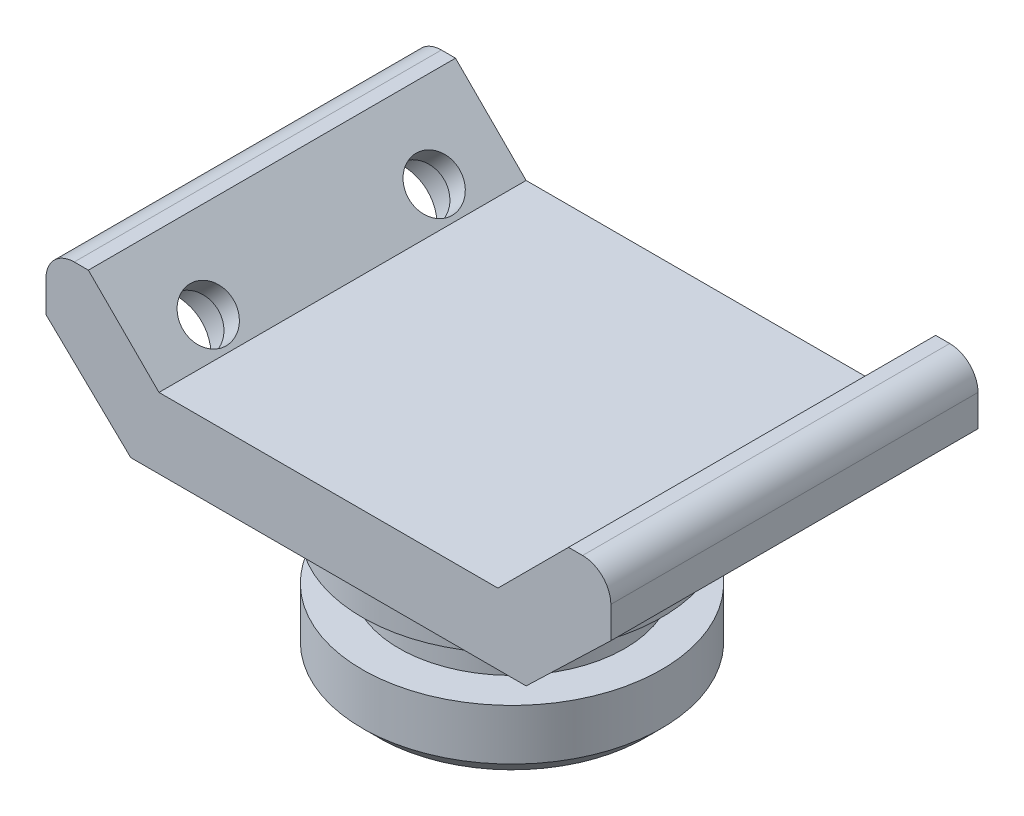
ISO-10303-21;
HEADER;
FILE_DESCRIPTION(('STEP AP214'),'2;1');
FILE_NAME('part.step','',(''),(''),'','','');
FILE_SCHEMA(('AUTOMOTIVE_DESIGN { 1 0 10303 214 1 1 1 1 }'));
ENDSEC;
DATA;
#1=APPLICATION_CONTEXT('core data for automotive mechanical design processes');
#2=APPLICATION_PROTOCOL_DEFINITION('international standard','automotive_design',2000,#1);
#3=PRODUCT_CONTEXT('',#1,'mechanical');
#4=PRODUCT('Part','Part','',(#3));
#5=PRODUCT_RELATED_PRODUCT_CATEGORY('part','',(#4));
#6=PRODUCT_DEFINITION_FORMATION('','',#4);
#7=PRODUCT_DEFINITION_CONTEXT('part definition',#1,'design');
#8=PRODUCT_DEFINITION('design','',#6,#7);
#9=PRODUCT_DEFINITION_SHAPE('','',#8);
#10=(LENGTH_UNIT() NAMED_UNIT(*) SI_UNIT(.MILLI.,.METRE.));
#11=(NAMED_UNIT(*) PLANE_ANGLE_UNIT() SI_UNIT($,.RADIAN.));
#12=(NAMED_UNIT(*) SI_UNIT($,.STERADIAN.) SOLID_ANGLE_UNIT());
#13=UNCERTAINTY_MEASURE_WITH_UNIT(LENGTH_MEASURE(1.E-05),#10,'distance_accuracy_value','');
#14=(GEOMETRIC_REPRESENTATION_CONTEXT(3) GLOBAL_UNCERTAINTY_ASSIGNED_CONTEXT((#13)) GLOBAL_UNIT_ASSIGNED_CONTEXT((#10,
#11,#12)) REPRESENTATION_CONTEXT('',''));
#15=CARTESIAN_POINT('',(0.,0.,0.));
#16=DIRECTION('',(0.,0.,1.));
#17=DIRECTION('',(1.,0.,0.));
#18=AXIS2_PLACEMENT_3D('',#15,#16,#17);
#19=CARTESIAN_POINT('',(35.,0.,32.5));
#20=DIRECTION('',(-0.693149330244424,0.720794010783737,0.));
#21=DIRECTION('',(-0.720794010783737,-0.693149330244424,0.));
#22=AXIS2_PLACEMENT_3D('',#19,#20,#21);
#23=PLANE('',#22);
#24=CARTESIAN_POINT('',(42.5,7.21235179407303,20.));
#25=DIRECTION('',(0.693149330244424,-0.720794010783737,0.));
#26=DIRECTION('',(0.720794010783737,0.693149330244424,0.));
#27=AXIS2_PLACEMENT_3D('',#24,#25,#26);
#28=CIRCLE('',#27,7.5);
#29=CARTESIAN_POINT('',(47.905955080878,12.4109717709062,20.));
#30=VERTEX_POINT('',#29);
#31=EDGE_CURVE('E182',#30,#30,#28,.T.);
#32=ORIENTED_EDGE('',*,*,#31,.F.);
#33=EDGE_LOOP('',(#32));
#34=FACE_BOUND('',#33,.T.);
#35=DIRECTION('',(0.720794010783737,0.693149330244424,0.));
#36=VECTOR('',#35,1.);
#37=CARTESIAN_POINT('',(35.,0.,-32.5));
#38=LINE('',#37,#36);
#39=CARTESIAN_POINT('',(35.,0.,-32.5));
#40=VERTEX_POINT('',#39);
#41=CARTESIAN_POINT('',(50.,14.4247035881461,-32.5));
#42=VERTEX_POINT('',#41);
#43=EDGE_CURVE('E218',#40,#42,#38,.T.);
#44=ORIENTED_EDGE('',*,*,#43,.T.);
#45=DIRECTION('',(0.,0.,-1.));
#46=VECTOR('',#45,1.);
#47=CARTESIAN_POINT('',(50.,14.4247035881461,32.5));
#48=LINE('',#47,#46);
#49=CARTESIAN_POINT('',(50.,14.4247035881461,32.5));
#50=VERTEX_POINT('',#49);
#51=EDGE_CURVE('E230',#50,#42,#48,.T.);
#52=ORIENTED_EDGE('',*,*,#51,.F.);
#53=DIRECTION('',(0.720794010783737,0.693149330244424,0.));
#54=VECTOR('',#53,1.);
#55=CARTESIAN_POINT('',(35.,0.,32.5));
#56=LINE('',#55,#54);
#57=CARTESIAN_POINT('',(35.,0.,32.5));
#58=VERTEX_POINT('',#57);
#59=EDGE_CURVE('E265',#58,#50,#56,.T.);
#60=ORIENTED_EDGE('',*,*,#59,.F.);
#61=DIRECTION('',(0.,0.,-1.));
#62=VECTOR('',#61,1.);
#63=CARTESIAN_POINT('',(35.,0.,32.5));
#64=LINE('',#63,#62);
#65=EDGE_CURVE('E233',#58,#40,#64,.T.);
#66=ORIENTED_EDGE('',*,*,#65,.T.);
#67=EDGE_LOOP('',(#44,#52,#60,#66));
#68=FACE_BOUND('',#67,.T.);
#69=CARTESIAN_POINT('',(42.5,7.21235179407303,-20.));
#70=DIRECTION('',(0.693149330244424,-0.720794010783737,0.));
#71=DIRECTION('',(0.720794010783737,0.693149330244424,0.));
#72=AXIS2_PLACEMENT_3D('',#69,#70,#71);
#73=CIRCLE('',#72,7.5);
#74=CARTESIAN_POINT('',(47.905955080878,12.4109717709062,-20.));
#75=VERTEX_POINT('',#74);
#76=EDGE_CURVE('E177',#75,#75,#73,.T.);
#77=ORIENTED_EDGE('',*,*,#76,.F.);
#78=EDGE_LOOP('',(#77));
#79=FACE_BOUND('',#78,.T.);
#80=ADVANCED_FACE('F44',(#34,#68,#79),#23,.F.);
#81=CARTESIAN_POINT('',(-35.,0.,32.5));
#82=DIRECTION('',(0.,1.,0.));
#83=DIRECTION('',(-1.,0.,0.));
#84=AXIS2_PLACEMENT_3D('',#81,#82,#83);
#85=PLANE('',#84);
#86=DIRECTION('',(1.,0.,0.));
#87=VECTOR('',#86,1.);
#88=CARTESIAN_POINT('',(-35.,0.,-32.5));
#89=LINE('',#88,#87);
#90=CARTESIAN_POINT('',(-35.,0.,-32.5));
#91=VERTEX_POINT('',#90);
#92=EDGE_CURVE('E243',#91,#40,#89,.T.);
#93=ORIENTED_EDGE('',*,*,#92,.T.);
#94=ORIENTED_EDGE('',*,*,#65,.F.);
#95=DIRECTION('',(1.,0.,0.));
#96=VECTOR('',#95,1.);
#97=CARTESIAN_POINT('',(-35.,0.,32.5));
#98=LINE('',#97,#96);
#99=CARTESIAN_POINT('',(-35.,0.,32.5));
#100=VERTEX_POINT('',#99);
#101=EDGE_CURVE('E244',#100,#58,#98,.T.);
#102=ORIENTED_EDGE('',*,*,#101,.F.);
#103=DIRECTION('',(0.,0.,-1.));
#104=VECTOR('',#103,1.);
#105=CARTESIAN_POINT('',(-35.,0.,32.5));
#106=LINE('',#105,#104);
#107=EDGE_CURVE('E165',#100,#91,#106,.T.);
#108=ORIENTED_EDGE('',*,*,#107,.T.);
#109=EDGE_LOOP('',(#93,#94,#102,#108));
#110=FACE_BOUND('',#109,.T.);
#111=CARTESIAN_POINT('',(0.,0.,0.));
#112=DIRECTION('',(0.,1.,0.));
#113=DIRECTION('',(-1.,0.,0.));
#114=AXIS2_PLACEMENT_3D('',#111,#112,#113);
#115=CIRCLE('',#114,26.5);
#116=CARTESIAN_POINT('',(-26.5,0.,0.));
#117=VERTEX_POINT('',#116);
#118=EDGE_CURVE('E158',#117,#117,#115,.F.);
#119=ORIENTED_EDGE('',*,*,#118,.F.);
#120=EDGE_LOOP('',(#119));
#121=FACE_BOUND('',#120,.T.);
#122=ADVANCED_FACE('F240',(#110,#121),#85,.F.);
#123=CARTESIAN_POINT('',(-42.5,25.,32.5));
#124=DIRECTION('',(-0.707106781186547,-0.707106781186548,0.));
#125=DIRECTION('',(0.707106781186548,-0.707106781186547,0.));
#126=AXIS2_PLACEMENT_3D('',#123,#124,#125);
#127=PLANE('',#126);
#128=CARTESIAN_POINT('',(-33.7800632933451,16.2800632933451,20.));
#129=DIRECTION('',(-0.707106781186547,-0.707106781186548,0.));
#130=DIRECTION('',(0.707106781186548,-0.707106781186547,0.));
#131=AXIS2_PLACEMENT_3D('',#128,#129,#130);
#132=ELLIPSE('',#131,4.50086000337984,4.49999999999999);
#133=CARTESIAN_POINT('',(-30.5974746637839,13.0974746637839,20.));
#134=VERTEX_POINT('',#133);
#135=EDGE_CURVE('E184',#134,#134,#132,.T.);
#136=ORIENTED_EDGE('',*,*,#135,.T.);
#137=EDGE_LOOP('',(#136));
#138=FACE_BOUND('',#137,.T.);
#139=CARTESIAN_POINT('',(-33.7800632933451,16.2800632933451,-20.));
#140=DIRECTION('',(-0.707106781186547,-0.707106781186548,0.));
#141=DIRECTION('',(0.707106781186548,-0.707106781186547,0.));
#142=AXIS2_PLACEMENT_3D('',#139,#140,#141);
#143=ELLIPSE('',#142,4.50086000337984,4.49999999999999);
#144=CARTESIAN_POINT('',(-30.5974746637839,13.0974746637839,-20.));
#145=VERTEX_POINT('',#144);
#146=EDGE_CURVE('E179',#145,#145,#143,.T.);
#147=ORIENTED_EDGE('',*,*,#146,.T.);
#148=EDGE_LOOP('',(#147));
#149=FACE_BOUND('',#148,.T.);
#150=DIRECTION('',(-0.707106781186548,0.707106781186547,0.));
#151=VECTOR('',#150,1.);
#152=CARTESIAN_POINT('',(-42.5,25.,-32.5));
#153=LINE('',#152,#151);
#154=CARTESIAN_POINT('',(-30.,12.5,-32.5));
#155=VERTEX_POINT('',#154);
#156=CARTESIAN_POINT('',(-42.5,25.,-32.5));
#157=VERTEX_POINT('',#156);
#158=EDGE_CURVE('E157',#155,#157,#153,.T.);
#159=ORIENTED_EDGE('',*,*,#158,.T.);
#160=DIRECTION('',(0.,0.,-1.));
#161=VECTOR('',#160,1.);
#162=CARTESIAN_POINT('',(-42.5,25.,32.5));
#163=LINE('',#162,#161);
#164=CARTESIAN_POINT('',(-42.5,25.,32.5));
#165=VERTEX_POINT('',#164);
#166=EDGE_CURVE('E138',#165,#157,#163,.T.);
#167=ORIENTED_EDGE('',*,*,#166,.F.);
#168=DIRECTION('',(-0.707106781186548,0.707106781186547,0.));
#169=VECTOR('',#168,1.);
#170=CARTESIAN_POINT('',(-42.5,25.,32.5));
#171=LINE('',#170,#169);
#172=CARTESIAN_POINT('',(-30.,12.5,32.5));
#173=VERTEX_POINT('',#172);
#174=EDGE_CURVE('E144',#173,#165,#171,.T.);
#175=ORIENTED_EDGE('',*,*,#174,.F.);
#176=DIRECTION('',(0.,0.,-1.));
#177=VECTOR('',#176,1.);
#178=CARTESIAN_POINT('',(-30.,12.5,32.5));
#179=LINE('',#178,#177);
#180=EDGE_CURVE('E223',#173,#155,#179,.T.);
#181=ORIENTED_EDGE('',*,*,#180,.T.);
#182=EDGE_LOOP('',(#159,#167,#175,#181));
#183=FACE_BOUND('',#182,.T.);
#184=ADVANCED_FACE('F155',(#138,#149,#183),#127,.F.);
#185=CARTESIAN_POINT('',(-50.,25.,32.5));
#186=DIRECTION('',(0.,-1.,0.));
#187=DIRECTION('',(0.,0.,-1.));
#188=AXIS2_PLACEMENT_3D('',#185,#186,#187);
#189=PLANE('',#188);
#190=DIRECTION('',(-1.,0.,0.));
#191=VECTOR('',#190,1.);
#192=CARTESIAN_POINT('',(-50.,25.,-32.5));
#193=LINE('',#192,#191);
#194=CARTESIAN_POINT('',(-45.,25.,-32.5));
#195=VERTEX_POINT('',#194);
#196=EDGE_CURVE('E255',#157,#195,#193,.T.);
#197=ORIENTED_EDGE('',*,*,#196,.T.);
#198=DIRECTION('',(0.,0.,-1.));
#199=VECTOR('',#198,1.);
#200=CARTESIAN_POINT('',(-45.,25.,32.5));
#201=LINE('',#200,#199);
#202=CARTESIAN_POINT('',(-45.,25.,32.5));
#203=VERTEX_POINT('',#202);
#204=EDGE_CURVE('E141',#195,#203,#201,.F.);
#205=ORIENTED_EDGE('',*,*,#204,.T.);
#206=DIRECTION('',(-1.,0.,0.));
#207=VECTOR('',#206,1.);
#208=CARTESIAN_POINT('',(-50.,25.,32.5));
#209=LINE('',#208,#207);
#210=EDGE_CURVE('E133',#165,#203,#209,.T.);
#211=ORIENTED_EDGE('',*,*,#210,.F.);
#212=ORIENTED_EDGE('',*,*,#166,.T.);
#213=EDGE_LOOP('',(#197,#205,#211,#212));
#214=FACE_BOUND('',#213,.T.);
#215=ADVANCED_FACE('F136',(#214),#189,.F.);
#216=CARTESIAN_POINT('',(-50.,14.4247035881461,32.5));
#217=DIRECTION('',(1.,0.,0.));
#218=DIRECTION('',(0.,0.,-1.));
#219=AXIS2_PLACEMENT_3D('',#216,#217,#218);
#220=PLANE('',#219);
#221=DIRECTION('',(0.,-1.,0.));
#222=VECTOR('',#221,1.);
#223=CARTESIAN_POINT('',(-50.,14.4247035881461,32.5));
#224=LINE('',#223,#222);
#225=CARTESIAN_POINT('',(-50.,20.,32.5));
#226=VERTEX_POINT('',#225);
#227=CARTESIAN_POINT('',(-50.,14.4247035881461,32.5));
#228=VERTEX_POINT('',#227);
#229=EDGE_CURVE('E143',#226,#228,#224,.T.);
#230=ORIENTED_EDGE('',*,*,#229,.F.);
#231=DIRECTION('',(0.,0.,-1.));
#232=VECTOR('',#231,1.);
#233=CARTESIAN_POINT('',(-50.,20.,32.5));
#234=LINE('',#233,#232);
#235=CARTESIAN_POINT('',(-50.,20.,-32.5));
#236=VERTEX_POINT('',#235);
#237=EDGE_CURVE('E162',#226,#236,#234,.T.);
#238=ORIENTED_EDGE('',*,*,#237,.T.);
#239=DIRECTION('',(0.,-1.,0.));
#240=VECTOR('',#239,1.);
#241=CARTESIAN_POINT('',(-50.,14.4247035881461,-32.5));
#242=LINE('',#241,#240);
#243=CARTESIAN_POINT('',(-50.,14.4247035881461,-32.5));
#244=VERTEX_POINT('',#243);
#245=EDGE_CURVE('E251',#236,#244,#242,.T.);
#246=ORIENTED_EDGE('',*,*,#245,.T.);
#247=DIRECTION('',(0.,0.,-1.));
#248=VECTOR('',#247,1.);
#249=CARTESIAN_POINT('',(-50.,14.4247035881461,32.5));
#250=LINE('',#249,#248);
#251=EDGE_CURVE('E159',#228,#244,#250,.T.);
#252=ORIENTED_EDGE('',*,*,#251,.F.);
#253=EDGE_LOOP('',(#230,#238,#246,#252));
#254=FACE_BOUND('',#253,.T.);
#255=ADVANCED_FACE('F323',(#254),#220,.F.);
#256=CARTESIAN_POINT('',(-35.,0.,32.5));
#257=DIRECTION('',(0.693149330244424,0.720794010783737,0.));
#258=DIRECTION('',(-0.720794010783737,0.693149330244424,0.));
#259=AXIS2_PLACEMENT_3D('',#256,#257,#258);
#260=PLANE('',#259);
#261=CARTESIAN_POINT('',(-42.5,7.21235179407303,20.));
#262=DIRECTION('',(-0.693149330244424,-0.720794010783737,0.));
#263=DIRECTION('',(0.720794010783737,-0.693149330244424,0.));
#264=AXIS2_PLACEMENT_3D('',#261,#262,#263);
#265=CIRCLE('',#264,7.5);
#266=CARTESIAN_POINT('',(-37.094044919122,2.01373181723985,20.));
#267=VERTEX_POINT('',#266);
#268=EDGE_CURVE('E313',#267,#267,#265,.T.);
#269=ORIENTED_EDGE('',*,*,#268,.F.);
#270=EDGE_LOOP('',(#269));
#271=FACE_BOUND('',#270,.T.);
#272=CARTESIAN_POINT('',(-42.5,7.21235179407303,-20.));
#273=DIRECTION('',(-0.693149330244424,-0.720794010783737,0.));
#274=DIRECTION('',(0.720794010783737,-0.693149330244424,0.));
#275=AXIS2_PLACEMENT_3D('',#272,#273,#274);
#276=CIRCLE('',#275,7.5);
#277=CARTESIAN_POINT('',(-37.094044919122,2.01373181723985,-20.));
#278=VERTEX_POINT('',#277);
#279=EDGE_CURVE('E187',#278,#278,#276,.T.);
#280=ORIENTED_EDGE('',*,*,#279,.F.);
#281=EDGE_LOOP('',(#280));
#282=FACE_BOUND('',#281,.T.);
#283=DIRECTION('',(0.720794010783737,-0.693149330244424,0.));
#284=VECTOR('',#283,1.);
#285=CARTESIAN_POINT('',(-35.,0.,-32.5));
#286=LINE('',#285,#284);
#287=EDGE_CURVE('E249',#244,#91,#286,.T.);
#288=ORIENTED_EDGE('',*,*,#287,.T.);
#289=ORIENTED_EDGE('',*,*,#107,.F.);
#290=DIRECTION('',(0.720794010783737,-0.693149330244424,0.));
#291=VECTOR('',#290,1.);
#292=CARTESIAN_POINT('',(-35.,0.,32.5));
#293=LINE('',#292,#291);
#294=EDGE_CURVE('E268',#228,#100,#293,.T.);
#295=ORIENTED_EDGE('',*,*,#294,.F.);
#296=ORIENTED_EDGE('',*,*,#251,.T.);
#297=EDGE_LOOP('',(#288,#289,#295,#296));
#298=FACE_BOUND('',#297,.T.);
#299=ADVANCED_FACE('F319',(#271,#282,#298),#260,.F.);
#300=CARTESIAN_POINT('',(50.,14.4247035881461,32.5));
#301=DIRECTION('',(-1.,0.,0.));
#302=DIRECTION('',(0.,0.,1.));
#303=AXIS2_PLACEMENT_3D('',#300,#301,#302);
#304=PLANE('',#303);
#305=DIRECTION('',(0.,1.,0.));
#306=VECTOR('',#305,1.);
#307=CARTESIAN_POINT('',(50.,14.4247035881461,-32.5));
#308=LINE('',#307,#306);
#309=CARTESIAN_POINT('',(50.,20.,-32.5));
#310=VERTEX_POINT('',#309);
#311=EDGE_CURVE('E215',#42,#310,#308,.T.);
#312=ORIENTED_EDGE('',*,*,#311,.T.);
#313=DIRECTION('',(0.,0.,-1.));
#314=VECTOR('',#313,1.);
#315=CARTESIAN_POINT('',(50.,20.,32.5));
#316=LINE('',#315,#314);
#317=CARTESIAN_POINT('',(50.,20.,32.5));
#318=VERTEX_POINT('',#317);
#319=EDGE_CURVE('E13',#310,#318,#316,.F.);
#320=ORIENTED_EDGE('',*,*,#319,.T.);
#321=DIRECTION('',(0.,1.,0.));
#322=VECTOR('',#321,1.);
#323=CARTESIAN_POINT('',(50.,14.4247035881461,32.5));
#324=LINE('',#323,#322);
#325=EDGE_CURVE('E263',#50,#318,#324,.T.);
#326=ORIENTED_EDGE('',*,*,#325,.F.);
#327=ORIENTED_EDGE('',*,*,#51,.T.);
#328=EDGE_LOOP('',(#312,#320,#326,#327));
#329=FACE_BOUND('',#328,.T.);
#330=ADVANCED_FACE('F322',(#329),#304,.F.);
#331=CARTESIAN_POINT('',(50.,25.,32.5));
#332=DIRECTION('',(0.,-1.,0.));
#333=DIRECTION('',(0.,0.,-1.));
#334=AXIS2_PLACEMENT_3D('',#331,#332,#333);
#335=PLANE('',#334);
#336=DIRECTION('',(-1.,0.,0.));
#337=VECTOR('',#336,1.);
#338=CARTESIAN_POINT('',(50.,25.,32.5));
#339=LINE('',#338,#337);
#340=CARTESIAN_POINT('',(45.,25.,32.5));
#341=VERTEX_POINT('',#340);
#342=CARTESIAN_POINT('',(42.5,25.,32.5));
#343=VERTEX_POINT('',#342);
#344=EDGE_CURVE('E206',#341,#343,#339,.T.);
#345=ORIENTED_EDGE('',*,*,#344,.F.);
#346=DIRECTION('',(0.,0.,-1.));
#347=VECTOR('',#346,1.);
#348=CARTESIAN_POINT('',(45.,25.,32.5));
#349=LINE('',#348,#347);
#350=CARTESIAN_POINT('',(45.,25.,-32.5));
#351=VERTEX_POINT('',#350);
#352=EDGE_CURVE('E52',#341,#351,#349,.T.);
#353=ORIENTED_EDGE('',*,*,#352,.T.);
#354=DIRECTION('',(-1.,0.,0.));
#355=VECTOR('',#354,1.);
#356=CARTESIAN_POINT('',(50.,25.,-32.5));
#357=LINE('',#356,#355);
#358=CARTESIAN_POINT('',(42.5,25.,-32.5));
#359=VERTEX_POINT('',#358);
#360=EDGE_CURVE('E204',#351,#359,#357,.T.);
#361=ORIENTED_EDGE('',*,*,#360,.T.);
#362=DIRECTION('',(0.,0.,-1.));
#363=VECTOR('',#362,1.);
#364=CARTESIAN_POINT('',(42.5,25.,32.5));
#365=LINE('',#364,#363);
#366=EDGE_CURVE('E228',#343,#359,#365,.T.);
#367=ORIENTED_EDGE('',*,*,#366,.F.);
#368=EDGE_LOOP('',(#345,#353,#361,#367));
#369=FACE_BOUND('',#368,.T.);
#370=ADVANCED_FACE('F202',(#369),#335,.F.);
#371=CARTESIAN_POINT('',(42.5,25.,32.5));
#372=DIRECTION('',(0.707106781186547,-0.707106781186547,0.));
#373=DIRECTION('',(0.707106781186548,0.707106781186548,0.));
#374=AXIS2_PLACEMENT_3D('',#371,#372,#373);
#375=PLANE('',#374);
#376=CARTESIAN_POINT('',(33.7800632933451,16.2800632933451,20.));
#377=DIRECTION('',(0.707106781186547,-0.707106781186547,0.));
#378=DIRECTION('',(-0.707106781186548,-0.707106781186548,0.));
#379=AXIS2_PLACEMENT_3D('',#376,#377,#378);
#380=ELLIPSE('',#379,4.50086000337984,4.49999999999999);
#381=CARTESIAN_POINT('',(30.5974746637839,13.0974746637839,20.));
#382=VERTEX_POINT('',#381);
#383=EDGE_CURVE('E174',#382,#382,#380,.T.);
#384=ORIENTED_EDGE('',*,*,#383,.T.);
#385=EDGE_LOOP('',(#384));
#386=FACE_BOUND('',#385,.T.);
#387=CARTESIAN_POINT('',(33.7800632933451,16.2800632933451,-20.));
#388=DIRECTION('',(0.707106781186547,-0.707106781186547,0.));
#389=DIRECTION('',(-0.707106781186548,-0.707106781186548,0.));
#390=AXIS2_PLACEMENT_3D('',#387,#388,#389);
#391=ELLIPSE('',#390,4.50086000337984,4.49999999999999);
#392=CARTESIAN_POINT('',(30.5974746637839,13.0974746637839,-20.));
#393=VERTEX_POINT('',#392);
#394=EDGE_CURVE('E169',#393,#393,#391,.T.);
#395=ORIENTED_EDGE('',*,*,#394,.T.);
#396=EDGE_LOOP('',(#395));
#397=FACE_BOUND('',#396,.T.);
#398=DIRECTION('',(-0.707106781186547,-0.707106781186547,0.));
#399=VECTOR('',#398,1.);
#400=CARTESIAN_POINT('',(42.5,25.,-32.5));
#401=LINE('',#400,#399);
#402=CARTESIAN_POINT('',(30.,12.5,-32.5));
#403=VERTEX_POINT('',#402);
#404=EDGE_CURVE('E214',#359,#403,#401,.T.);
#405=ORIENTED_EDGE('',*,*,#404,.T.);
#406=DIRECTION('',(0.,0.,-1.));
#407=VECTOR('',#406,1.);
#408=CARTESIAN_POINT('',(30.,12.5,32.5));
#409=LINE('',#408,#407);
#410=CARTESIAN_POINT('',(30.,12.5,32.5));
#411=VERTEX_POINT('',#410);
#412=EDGE_CURVE('E225',#411,#403,#409,.T.);
#413=ORIENTED_EDGE('',*,*,#412,.F.);
#414=DIRECTION('',(-0.707106781186547,-0.707106781186547,0.));
#415=VECTOR('',#414,1.);
#416=CARTESIAN_POINT('',(42.5,25.,32.5));
#417=LINE('',#416,#415);
#418=EDGE_CURVE('E260',#343,#411,#417,.T.);
#419=ORIENTED_EDGE('',*,*,#418,.F.);
#420=ORIENTED_EDGE('',*,*,#366,.T.);
#421=EDGE_LOOP('',(#405,#413,#419,#420));
#422=FACE_BOUND('',#421,.T.);
#423=ADVANCED_FACE('F435',(#386,#397,#422),#375,.F.);
#424=CARTESIAN_POINT('',(30.,12.5,32.5));
#425=DIRECTION('',(0.,-1.,0.));
#426=DIRECTION('',(1.,0.,0.));
#427=AXIS2_PLACEMENT_3D('',#424,#425,#426);
#428=PLANE('',#427);
#429=DIRECTION('',(-1.,0.,0.));
#430=VECTOR('',#429,1.);
#431=CARTESIAN_POINT('',(30.,12.5,-32.5));
#432=LINE('',#431,#430);
#433=EDGE_CURVE('E153',#403,#155,#432,.T.);
#434=ORIENTED_EDGE('',*,*,#433,.T.);
#435=ORIENTED_EDGE('',*,*,#180,.F.);
#436=DIRECTION('',(-1.,0.,0.));
#437=VECTOR('',#436,1.);
#438=CARTESIAN_POINT('',(30.,12.5,32.5));
#439=LINE('',#438,#437);
#440=EDGE_CURVE('E149',#411,#173,#439,.T.);
#441=ORIENTED_EDGE('',*,*,#440,.F.);
#442=ORIENTED_EDGE('',*,*,#412,.T.);
#443=EDGE_LOOP('',(#434,#435,#441,#442));
#444=FACE_BOUND('',#443,.T.);
#445=ADVANCED_FACE('F430',(#444),#428,.F.);
#446=CARTESIAN_POINT('',(0.,0.,32.5));
#447=DIRECTION('',(0.,0.,-1.));
#448=DIRECTION('',(-1.,0.,0.));
#449=AXIS2_PLACEMENT_3D('',#446,#447,#448);
#450=PLANE('',#449);
#451=ORIENTED_EDGE('',*,*,#210,.T.);
#452=CARTESIAN_POINT('',(-45.,20.,32.5));
#453=DIRECTION('',(0.,0.,-1.));
#454=DIRECTION('',(-1.,0.,0.));
#455=AXIS2_PLACEMENT_3D('',#452,#453,#454);
#456=CIRCLE('',#455,5.);
#457=EDGE_CURVE('E197',#203,#226,#456,.F.);
#458=ORIENTED_EDGE('',*,*,#457,.T.);
#459=ORIENTED_EDGE('',*,*,#229,.T.);
#460=ORIENTED_EDGE('',*,*,#294,.T.);
#461=ORIENTED_EDGE('',*,*,#101,.T.);
#462=ORIENTED_EDGE('',*,*,#59,.T.);
#463=ORIENTED_EDGE('',*,*,#325,.T.);
#464=CARTESIAN_POINT('',(45.,20.,32.5));
#465=DIRECTION('',(0.,0.,-1.));
#466=DIRECTION('',(-1.,0.,0.));
#467=AXIS2_PLACEMENT_3D('',#464,#465,#466);
#468=CIRCLE('',#467,5.);
#469=EDGE_CURVE('E59',#318,#341,#468,.F.);
#470=ORIENTED_EDGE('',*,*,#469,.T.);
#471=ORIENTED_EDGE('',*,*,#344,.T.);
#472=ORIENTED_EDGE('',*,*,#418,.T.);
#473=ORIENTED_EDGE('',*,*,#440,.T.);
#474=ORIENTED_EDGE('',*,*,#174,.T.);
#475=EDGE_LOOP('',(#451,#458,#459,#460,#461,#462,#463,#470,#471,#472,#473,#474));
#476=FACE_BOUND('',#475,.T.);
#477=ADVANCED_FACE('F147',(#476),#450,.F.);
#478=CARTESIAN_POINT('',(0.,0.,-32.5));
#479=DIRECTION('',(0.,0.,-1.));
#480=DIRECTION('',(-1.,0.,0.));
#481=AXIS2_PLACEMENT_3D('',#478,#479,#480);
#482=PLANE('',#481);
#483=ORIENTED_EDGE('',*,*,#245,.F.);
#484=CARTESIAN_POINT('',(-45.,20.,-32.5));
#485=DIRECTION('',(0.,0.,-1.));
#486=DIRECTION('',(-1.,0.,0.));
#487=AXIS2_PLACEMENT_3D('',#484,#485,#486);
#488=CIRCLE('',#487,5.);
#489=EDGE_CURVE('E193',#236,#195,#488,.T.);
#490=ORIENTED_EDGE('',*,*,#489,.T.);
#491=ORIENTED_EDGE('',*,*,#196,.F.);
#492=ORIENTED_EDGE('',*,*,#158,.F.);
#493=ORIENTED_EDGE('',*,*,#433,.F.);
#494=ORIENTED_EDGE('',*,*,#404,.F.);
#495=ORIENTED_EDGE('',*,*,#360,.F.);
#496=CARTESIAN_POINT('',(45.,20.,-32.5));
#497=DIRECTION('',(0.,0.,-1.));
#498=DIRECTION('',(-1.,0.,0.));
#499=AXIS2_PLACEMENT_3D('',#496,#497,#498);
#500=CIRCLE('',#499,5.);
#501=EDGE_CURVE('E191',#351,#310,#500,.T.);
#502=ORIENTED_EDGE('',*,*,#501,.T.);
#503=ORIENTED_EDGE('',*,*,#311,.F.);
#504=ORIENTED_EDGE('',*,*,#43,.F.);
#505=ORIENTED_EDGE('',*,*,#92,.F.);
#506=ORIENTED_EDGE('',*,*,#287,.F.);
#507=EDGE_LOOP('',(#483,#490,#491,#492,#493,#494,#495,#502,#503,#504,#505,#506));
#508=FACE_BOUND('',#507,.T.);
#509=ADVANCED_FACE('F211',(#508),#482,.T.);
#510=CARTESIAN_POINT('',(0.,-30.,0.));
#511=DIRECTION('',(0.,1.,0.));
#512=DIRECTION('',(-1.,0.,0.));
#513=AXIS2_PLACEMENT_3D('',#510,#511,#512);
#514=PLANE('',#513);
#515=CARTESIAN_POINT('',(0.,-30.,0.));
#516=DIRECTION('',(0.,1.,0.));
#517=DIRECTION('',(-1.,0.,0.));
#518=AXIS2_PLACEMENT_3D('',#515,#516,#517);
#519=CIRCLE('',#518,23.5);
#520=CARTESIAN_POINT('',(-23.5,-30.,0.));
#521=VERTEX_POINT('',#520);
#522=EDGE_CURVE('E258',#521,#521,#519,.T.);
#523=ORIENTED_EDGE('',*,*,#522,.F.);
#524=EDGE_LOOP('',(#523));
#525=FACE_BOUND('',#524,.T.);
#526=ADVANCED_FACE('F423',(#525),#514,.F.);
#527=CARTESIAN_POINT('',(0.,-30.,0.));
#528=DIRECTION('',(0.,1.,0.));
#529=DIRECTION('',(-1.,0.,0.));
#530=AXIS2_PLACEMENT_3D('',#527,#528,#529);
#531=CONICAL_SURFACE('',#530,23.5,0.785398163397448);
#532=CARTESIAN_POINT('',(0.,-27.,0.));
#533=DIRECTION('',(0.,1.,0.));
#534=DIRECTION('',(-1.,0.,0.));
#535=AXIS2_PLACEMENT_3D('',#532,#533,#534);
#536=CIRCLE('',#535,26.5);
#537=CARTESIAN_POINT('',(-26.5,-27.,0.));
#538=VERTEX_POINT('',#537);
#539=EDGE_CURVE('E273',#538,#538,#536,.T.);
#540=ORIENTED_EDGE('',*,*,#539,.F.);
#541=EDGE_LOOP('',(#540));
#542=FACE_BOUND('',#541,.T.);
#543=ORIENTED_EDGE('',*,*,#522,.T.);
#544=EDGE_LOOP('',(#543));
#545=FACE_BOUND('',#544,.T.);
#546=ADVANCED_FACE('F419',(#542,#545),#531,.T.);
#547=CARTESIAN_POINT('',(0.,0.,0.));
#548=DIRECTION('',(0.,1.,0.));
#549=DIRECTION('',(-1.,0.,0.));
#550=AXIS2_PLACEMENT_3D('',#547,#548,#549);
#551=CYLINDRICAL_SURFACE('',#550,26.5);
#552=CARTESIAN_POINT('',(0.,-18.,0.));
#553=DIRECTION('',(0.,1.,0.));
#554=DIRECTION('',(-1.,0.,0.));
#555=AXIS2_PLACEMENT_3D('',#552,#553,#554);
#556=CIRCLE('',#555,26.5);
#557=CARTESIAN_POINT('',(-26.5,-18.,0.));
#558=VERTEX_POINT('',#557);
#559=EDGE_CURVE('E276',#558,#558,#556,.T.);
#560=ORIENTED_EDGE('',*,*,#559,.F.);
#561=EDGE_LOOP('',(#560));
#562=FACE_BOUND('',#561,.T.);
#563=ORIENTED_EDGE('',*,*,#539,.T.);
#564=EDGE_LOOP('',(#563));
#565=FACE_BOUND('',#564,.T.);
#566=ADVANCED_FACE('F415',(#562,#565),#551,.T.);
#567=CARTESIAN_POINT('',(26.5,-18.,0.));
#568=DIRECTION('',(0.,-1.,0.));
#569=DIRECTION('',(1.,0.,0.));
#570=AXIS2_PLACEMENT_3D('',#567,#568,#569);
#571=PLANE('',#570);
#572=CARTESIAN_POINT('',(0.,-18.,0.));
#573=DIRECTION('',(0.,1.,0.));
#574=DIRECTION('',(-1.,0.,0.));
#575=AXIS2_PLACEMENT_3D('',#572,#573,#574);
#576=CIRCLE('',#575,20.);
#577=CARTESIAN_POINT('',(-20.,-18.,0.));
#578=VERTEX_POINT('',#577);
#579=EDGE_CURVE('E279',#578,#578,#576,.T.);
#580=ORIENTED_EDGE('',*,*,#579,.F.);
#581=EDGE_LOOP('',(#580));
#582=FACE_BOUND('',#581,.T.);
#583=ORIENTED_EDGE('',*,*,#559,.T.);
#584=EDGE_LOOP('',(#583));
#585=FACE_BOUND('',#584,.T.);
#586=ADVANCED_FACE('F411',(#582,#585),#571,.F.);
#587=CARTESIAN_POINT('',(0.,0.,0.));
#588=DIRECTION('',(0.,1.,0.));
#589=DIRECTION('',(-1.,0.,0.));
#590=AXIS2_PLACEMENT_3D('',#587,#588,#589);
#591=CYLINDRICAL_SURFACE('',#590,20.);
#592=CARTESIAN_POINT('',(0.,-10.,0.));
#593=DIRECTION('',(0.,1.,0.));
#594=DIRECTION('',(-1.,0.,0.));
#595=AXIS2_PLACEMENT_3D('',#592,#593,#594);
#596=CIRCLE('',#595,20.);
#597=CARTESIAN_POINT('',(-20.,-10.,0.));
#598=VERTEX_POINT('',#597);
#599=EDGE_CURVE('E282',#598,#598,#596,.T.);
#600=ORIENTED_EDGE('',*,*,#599,.F.);
#601=EDGE_LOOP('',(#600));
#602=FACE_BOUND('',#601,.T.);
#603=ORIENTED_EDGE('',*,*,#579,.T.);
#604=EDGE_LOOP('',(#603));
#605=FACE_BOUND('',#604,.T.);
#606=ADVANCED_FACE('F407',(#602,#605),#591,.T.);
#607=CARTESIAN_POINT('',(26.5,-10.,0.));
#608=DIRECTION('',(0.,1.,0.));
#609=DIRECTION('',(-1.,0.,0.));
#610=AXIS2_PLACEMENT_3D('',#607,#608,#609);
#611=PLANE('',#610);
#612=CARTESIAN_POINT('',(0.,-10.,0.));
#613=DIRECTION('',(0.,1.,0.));
#614=DIRECTION('',(-1.,0.,0.));
#615=AXIS2_PLACEMENT_3D('',#612,#613,#614);
#616=CIRCLE('',#615,26.5);
#617=CARTESIAN_POINT('',(-26.5,-10.,0.));
#618=VERTEX_POINT('',#617);
#619=EDGE_CURVE('E172',#618,#618,#616,.T.);
#620=ORIENTED_EDGE('',*,*,#619,.F.);
#621=EDGE_LOOP('',(#620));
#622=FACE_BOUND('',#621,.T.);
#623=ORIENTED_EDGE('',*,*,#599,.T.);
#624=EDGE_LOOP('',(#623));
#625=FACE_BOUND('',#624,.T.);
#626=ADVANCED_FACE('F403',(#622,#625),#611,.F.);
#627=CARTESIAN_POINT('',(0.,0.,0.));
#628=DIRECTION('',(0.,1.,0.));
#629=DIRECTION('',(-1.,0.,0.));
#630=AXIS2_PLACEMENT_3D('',#627,#628,#629);
#631=CYLINDRICAL_SURFACE('',#630,26.5);
#632=ORIENTED_EDGE('',*,*,#118,.T.);
#633=EDGE_LOOP('',(#632));
#634=FACE_BOUND('',#633,.T.);
#635=ORIENTED_EDGE('',*,*,#619,.T.);
#636=EDGE_LOOP('',(#635));
#637=FACE_BOUND('',#636,.T.);
#638=ADVANCED_FACE('F399',(#634,#637),#631,.T.);
#639=CARTESIAN_POINT('',(42.5,7.21235179407303,-20.));
#640=DIRECTION('',(0.693149330244424,-0.720794010783737,0.));
#641=DIRECTION('',(0.720794010783737,0.693149330244424,0.));
#642=AXIS2_PLACEMENT_3D('',#639,#640,#641);
#643=CYLINDRICAL_SURFACE('',#642,4.49999999999999);
#644=CARTESIAN_POINT('',(36.538915759898,13.4111802868132,-20.));
#645=DIRECTION('',(0.693149330244424,-0.720794010783737,0.));
#646=DIRECTION('',(0.720794010783737,0.693149330244424,0.));
#647=AXIS2_PLACEMENT_3D('',#644,#645,#646);
#648=CIRCLE('',#647,4.5);
#649=CARTESIAN_POINT('',(39.7824888084248,16.5303522729131,-20.));
#650=VERTEX_POINT('',#649);
#651=EDGE_CURVE('E173',#650,#650,#648,.T.);
#652=ORIENTED_EDGE('',*,*,#651,.T.);
#653=EDGE_LOOP('',(#652));
#654=FACE_BOUND('',#653,.T.);
#655=ORIENTED_EDGE('',*,*,#394,.F.);
#656=EDGE_LOOP('',(#655));
#657=FACE_BOUND('',#656,.T.);
#658=ADVANCED_FACE('F395',(#654,#657),#643,.F.);
#659=CARTESIAN_POINT('',(36.538915759898,13.4111802868132,-15.5));
#660=DIRECTION('',(-0.693149330244424,0.720794010783737,0.));
#661=DIRECTION('',(-0.720794010783737,-0.693149330244424,0.));
#662=AXIS2_PLACEMENT_3D('',#659,#660,#661);
#663=PLANE('',#662);
#664=ORIENTED_EDGE('',*,*,#651,.F.);
#665=EDGE_LOOP('',(#664));
#666=FACE_BOUND('',#665,.T.);
#667=CARTESIAN_POINT('',(36.538915759898,13.4111802868132,-20.));
#668=DIRECTION('',(0.693149330244424,-0.720794010783737,0.));
#669=DIRECTION('',(0.720794010783737,0.693149330244424,0.));
#670=AXIS2_PLACEMENT_3D('',#667,#668,#669);
#671=CIRCLE('',#670,7.5);
#672=CARTESIAN_POINT('',(41.944870840776,18.6098002636463,-20.));
#673=VERTEX_POINT('',#672);
#674=EDGE_CURVE('E289',#673,#673,#671,.T.);
#675=ORIENTED_EDGE('',*,*,#674,.T.);
#676=EDGE_LOOP('',(#675));
#677=FACE_BOUND('',#676,.T.);
#678=ADVANCED_FACE('F391',(#666,#677),#663,.F.);
#679=CARTESIAN_POINT('',(42.5,7.21235179407303,-20.));
#680=DIRECTION('',(0.693149330244424,-0.720794010783737,0.));
#681=DIRECTION('',(0.720794010783737,0.693149330244424,0.));
#682=AXIS2_PLACEMENT_3D('',#679,#680,#681);
#683=CYLINDRICAL_SURFACE('',#682,7.5);
#684=ORIENTED_EDGE('',*,*,#674,.F.);
#685=EDGE_LOOP('',(#684));
#686=FACE_BOUND('',#685,.T.);
#687=ORIENTED_EDGE('',*,*,#76,.T.);
#688=EDGE_LOOP('',(#687));
#689=FACE_BOUND('',#688,.T.);
#690=ADVANCED_FACE('F387',(#686,#689),#683,.F.);
#691=CARTESIAN_POINT('',(42.5,7.21235179407303,20.));
#692=DIRECTION('',(0.693149330244424,-0.720794010783737,0.));
#693=DIRECTION('',(0.720794010783737,0.693149330244424,0.));
#694=AXIS2_PLACEMENT_3D('',#691,#692,#693);
#695=CYLINDRICAL_SURFACE('',#694,4.49999999999999);
#696=CARTESIAN_POINT('',(36.5389157598979,13.4111802868132,20.));
#697=DIRECTION('',(0.693149330244424,-0.720794010783737,0.));
#698=DIRECTION('',(0.720794010783737,0.693149330244424,0.));
#699=AXIS2_PLACEMENT_3D('',#696,#697,#698);
#700=CIRCLE('',#699,4.5);
#701=CARTESIAN_POINT('',(39.7824888084248,16.5303522729131,20.));
#702=VERTEX_POINT('',#701);
#703=EDGE_CURVE('E178',#702,#702,#700,.T.);
#704=ORIENTED_EDGE('',*,*,#703,.T.);
#705=EDGE_LOOP('',(#704));
#706=FACE_BOUND('',#705,.T.);
#707=ORIENTED_EDGE('',*,*,#383,.F.);
#708=EDGE_LOOP('',(#707));
#709=FACE_BOUND('',#708,.T.);
#710=ADVANCED_FACE('F383',(#706,#709),#695,.F.);
#711=CARTESIAN_POINT('',(36.5389157598979,13.4111802868132,24.5));
#712=DIRECTION('',(-0.693149330244424,0.720794010783737,0.));
#713=DIRECTION('',(-0.720794010783737,-0.693149330244424,0.));
#714=AXIS2_PLACEMENT_3D('',#711,#712,#713);
#715=PLANE('',#714);
#716=ORIENTED_EDGE('',*,*,#703,.F.);
#717=EDGE_LOOP('',(#716));
#718=FACE_BOUND('',#717,.T.);
#719=CARTESIAN_POINT('',(36.5389157598979,13.4111802868132,20.));
#720=DIRECTION('',(0.693149330244424,-0.720794010783737,0.));
#721=DIRECTION('',(0.720794010783737,0.693149330244424,0.));
#722=AXIS2_PLACEMENT_3D('',#719,#720,#721);
#723=CIRCLE('',#722,7.5);
#724=CARTESIAN_POINT('',(41.944870840776,18.6098002636463,20.));
#725=VERTEX_POINT('',#724);
#726=EDGE_CURVE('E296',#725,#725,#723,.T.);
#727=ORIENTED_EDGE('',*,*,#726,.T.);
#728=EDGE_LOOP('',(#727));
#729=FACE_BOUND('',#728,.T.);
#730=ADVANCED_FACE('F376',(#718,#729),#715,.F.);
#731=CARTESIAN_POINT('',(42.5,7.21235179407303,20.));
#732=DIRECTION('',(0.693149330244424,-0.720794010783737,0.));
#733=DIRECTION('',(0.720794010783737,0.693149330244424,0.));
#734=AXIS2_PLACEMENT_3D('',#731,#732,#733);
#735=CYLINDRICAL_SURFACE('',#734,7.5);
#736=ORIENTED_EDGE('',*,*,#726,.F.);
#737=EDGE_LOOP('',(#736));
#738=FACE_BOUND('',#737,.T.);
#739=ORIENTED_EDGE('',*,*,#31,.T.);
#740=EDGE_LOOP('',(#739));
#741=FACE_BOUND('',#740,.T.);
#742=ADVANCED_FACE('F366',(#738,#741),#735,.F.);
#743=CARTESIAN_POINT('',(-42.5,7.21235179407303,-20.));
#744=DIRECTION('',(-0.693149330244424,-0.720794010783737,0.));
#745=DIRECTION('',(0.720794010783737,-0.693149330244424,0.));
#746=AXIS2_PLACEMENT_3D('',#743,#744,#745);
#747=CYLINDRICAL_SURFACE('',#746,4.49999999999999);
#748=CARTESIAN_POINT('',(-36.538915759898,13.4111802868132,-20.));
#749=DIRECTION('',(-0.693149330244424,-0.720794010783737,0.));
#750=DIRECTION('',(0.720794010783737,-0.693149330244424,0.));
#751=AXIS2_PLACEMENT_3D('',#748,#749,#750);
#752=CIRCLE('',#751,4.5);
#753=CARTESIAN_POINT('',(-33.2953427113711,10.2920083007133,-20.));
#754=VERTEX_POINT('',#753);
#755=EDGE_CURVE('E183',#754,#754,#752,.T.);
#756=ORIENTED_EDGE('',*,*,#755,.T.);
#757=EDGE_LOOP('',(#756));
#758=FACE_BOUND('',#757,.T.);
#759=ORIENTED_EDGE('',*,*,#146,.F.);
#760=EDGE_LOOP('',(#759));
#761=FACE_BOUND('',#760,.T.);
#762=ADVANCED_FACE('F363',(#758,#761),#747,.F.);
#763=CARTESIAN_POINT('',(-36.538915759898,13.4111802868132,-15.5));
#764=DIRECTION('',(0.693149330244424,0.720794010783737,0.));
#765=DIRECTION('',(-0.720794010783737,0.693149330244424,0.));
#766=AXIS2_PLACEMENT_3D('',#763,#764,#765);
#767=PLANE('',#766);
#768=ORIENTED_EDGE('',*,*,#755,.F.);
#769=EDGE_LOOP('',(#768));
#770=FACE_BOUND('',#769,.T.);
#771=CARTESIAN_POINT('',(-36.538915759898,13.4111802868132,-20.));
#772=DIRECTION('',(-0.693149330244424,-0.720794010783737,0.));
#773=DIRECTION('',(0.720794010783737,-0.693149330244424,0.));
#774=AXIS2_PLACEMENT_3D('',#771,#772,#773);
#775=CIRCLE('',#774,7.5);
#776=CARTESIAN_POINT('',(-31.1329606790199,8.21256030997999,-20.));
#777=VERTEX_POINT('',#776);
#778=EDGE_CURVE('E303',#777,#777,#775,.T.);
#779=ORIENTED_EDGE('',*,*,#778,.T.);
#780=EDGE_LOOP('',(#779));
#781=FACE_BOUND('',#780,.T.);
#782=ADVANCED_FACE('F365',(#770,#781),#767,.F.);
#783=CARTESIAN_POINT('',(-42.5,7.21235179407303,-20.));
#784=DIRECTION('',(-0.693149330244424,-0.720794010783737,0.));
#785=DIRECTION('',(0.720794010783737,-0.693149330244424,0.));
#786=AXIS2_PLACEMENT_3D('',#783,#784,#785);
#787=CYLINDRICAL_SURFACE('',#786,7.5);
#788=ORIENTED_EDGE('',*,*,#778,.F.);
#789=EDGE_LOOP('',(#788));
#790=FACE_BOUND('',#789,.T.);
#791=ORIENTED_EDGE('',*,*,#279,.T.);
#792=EDGE_LOOP('',(#791));
#793=FACE_BOUND('',#792,.T.);
#794=ADVANCED_FACE('F373',(#790,#793),#787,.F.);
#795=CARTESIAN_POINT('',(-42.5,7.21235179407303,20.));
#796=DIRECTION('',(-0.693149330244424,-0.720794010783737,0.));
#797=DIRECTION('',(0.720794010783737,-0.693149330244424,0.));
#798=AXIS2_PLACEMENT_3D('',#795,#796,#797);
#799=CYLINDRICAL_SURFACE('',#798,4.49999999999999);
#800=CARTESIAN_POINT('',(-36.5389157598979,13.4111802868132,20.));
#801=DIRECTION('',(-0.693149330244424,-0.720794010783737,0.));
#802=DIRECTION('',(0.720794010783737,-0.693149330244424,0.));
#803=AXIS2_PLACEMENT_3D('',#800,#801,#802);
#804=CIRCLE('',#803,4.5);
#805=CARTESIAN_POINT('',(-33.2953427113711,10.2920083007133,20.));
#806=VERTEX_POINT('',#805);
#807=EDGE_CURVE('E188',#806,#806,#804,.T.);
#808=ORIENTED_EDGE('',*,*,#807,.T.);
#809=EDGE_LOOP('',(#808));
#810=FACE_BOUND('',#809,.T.);
#811=ORIENTED_EDGE('',*,*,#135,.F.);
#812=EDGE_LOOP('',(#811));
#813=FACE_BOUND('',#812,.T.);
#814=ADVANCED_FACE('F478',(#810,#813),#799,.F.);
#815=CARTESIAN_POINT('',(-36.5389157598979,13.4111802868132,24.5));
#816=DIRECTION('',(0.693149330244424,0.720794010783737,0.));
#817=DIRECTION('',(-0.720794010783737,0.693149330244424,0.));
#818=AXIS2_PLACEMENT_3D('',#815,#816,#817);
#819=PLANE('',#818);
#820=ORIENTED_EDGE('',*,*,#807,.F.);
#821=EDGE_LOOP('',(#820));
#822=FACE_BOUND('',#821,.T.);
#823=CARTESIAN_POINT('',(-36.5389157598979,13.4111802868132,20.));
#824=DIRECTION('',(-0.693149330244424,-0.720794010783737,0.));
#825=DIRECTION('',(0.720794010783737,-0.693149330244424,0.));
#826=AXIS2_PLACEMENT_3D('',#823,#824,#825);
#827=CIRCLE('',#826,7.5);
#828=CARTESIAN_POINT('',(-31.1329606790199,8.21256030997998,20.));
#829=VERTEX_POINT('',#828);
#830=EDGE_CURVE('E310',#829,#829,#827,.T.);
#831=ORIENTED_EDGE('',*,*,#830,.T.);
#832=EDGE_LOOP('',(#831));
#833=FACE_BOUND('',#832,.T.);
#834=ADVANCED_FACE('F467',(#822,#833),#819,.F.);
#835=CARTESIAN_POINT('',(-42.5,7.21235179407303,20.));
#836=DIRECTION('',(-0.693149330244424,-0.720794010783737,0.));
#837=DIRECTION('',(0.720794010783737,-0.693149330244424,0.));
#838=AXIS2_PLACEMENT_3D('',#835,#836,#837);
#839=CYLINDRICAL_SURFACE('',#838,7.5);
#840=ORIENTED_EDGE('',*,*,#830,.F.);
#841=EDGE_LOOP('',(#840));
#842=FACE_BOUND('',#841,.T.);
#843=ORIENTED_EDGE('',*,*,#268,.T.);
#844=EDGE_LOOP('',(#843));
#845=FACE_BOUND('',#844,.T.);
#846=ADVANCED_FACE('F317',(#842,#845),#839,.F.);
#847=CARTESIAN_POINT('',(-45.,20.,32.5));
#848=DIRECTION('',(0.,0.,-1.));
#849=DIRECTION('',(-1.,0.,0.));
#850=AXIS2_PLACEMENT_3D('',#847,#848,#849);
#851=CYLINDRICAL_SURFACE('',#850,5.);
#852=ORIENTED_EDGE('',*,*,#457,.F.);
#853=ORIENTED_EDGE('',*,*,#204,.F.);
#854=ORIENTED_EDGE('',*,*,#489,.F.);
#855=ORIENTED_EDGE('',*,*,#237,.F.);
#856=EDGE_LOOP('',(#852,#853,#854,#855));
#857=FACE_BOUND('',#856,.T.);
#858=ADVANCED_FACE('F331',(#857),#851,.T.);
#859=CARTESIAN_POINT('',(45.,20.,32.5));
#860=DIRECTION('',(0.,0.,-1.));
#861=DIRECTION('',(-1.,0.,0.));
#862=AXIS2_PLACEMENT_3D('',#859,#860,#861);
#863=CYLINDRICAL_SURFACE('',#862,5.);
#864=ORIENTED_EDGE('',*,*,#469,.F.);
#865=ORIENTED_EDGE('',*,*,#319,.F.);
#866=ORIENTED_EDGE('',*,*,#501,.F.);
#867=ORIENTED_EDGE('',*,*,#352,.F.);
#868=EDGE_LOOP('',(#864,#865,#866,#867));
#869=FACE_BOUND('',#868,.T.);
#870=ADVANCED_FACE('F46',(#869),#863,.T.);
#871=CLOSED_SHELL('',(#80,#122,#184,#215,#255,#299,#330,#370,#423,#445,#477,#509,#526,#546,#566,
#586,#606,#626,#638,#658,#678,#690,#710,#730,#742,#762,#782,#794,#814,#834,#846,#858,#870));
#872=MANIFOLD_SOLID_BREP('B2',#871);
#873=ADVANCED_BREP_SHAPE_REPRESENTATION('',(#18,#872),#14);
#874=SHAPE_DEFINITION_REPRESENTATION(#9,#873);
ENDSEC;
END-ISO-10303-21;
